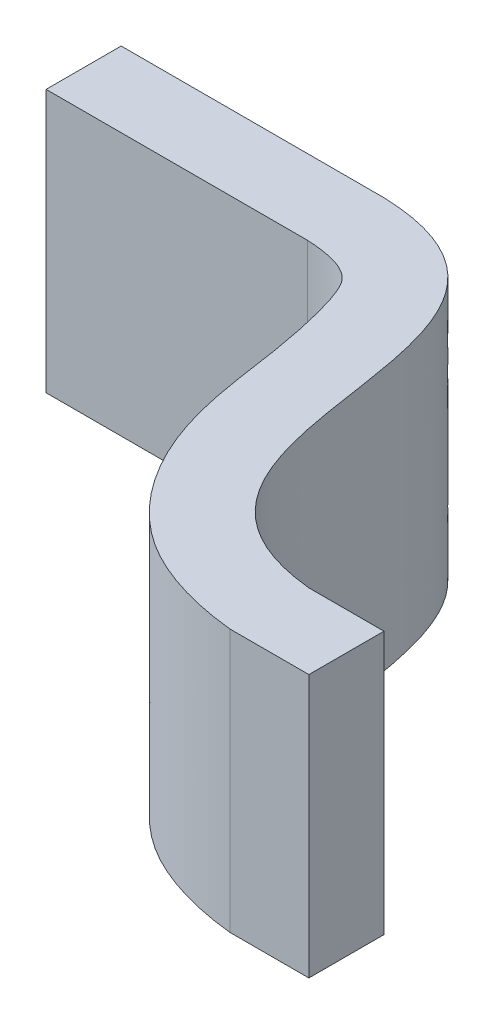
ISO-10303-21;
HEADER;
FILE_DESCRIPTION(('STEP AP214'),'2;1');
FILE_NAME('part.step','',(''),(''),'','','');
FILE_SCHEMA(('AUTOMOTIVE_DESIGN { 1 0 10303 214 1 1 1 1 }'));
ENDSEC;
DATA;
#1=APPLICATION_CONTEXT('core data for automotive mechanical design processes');
#2=APPLICATION_PROTOCOL_DEFINITION('international standard','automotive_design',2000,#1);
#3=PRODUCT_CONTEXT('',#1,'mechanical');
#4=PRODUCT('Part','Part','',(#3));
#5=PRODUCT_RELATED_PRODUCT_CATEGORY('part','',(#4));
#6=PRODUCT_DEFINITION_FORMATION('','',#4);
#7=PRODUCT_DEFINITION_CONTEXT('part definition',#1,'design');
#8=PRODUCT_DEFINITION('design','',#6,#7);
#9=PRODUCT_DEFINITION_SHAPE('','',#8);
#10=(LENGTH_UNIT() NAMED_UNIT(*) SI_UNIT(.MILLI.,.METRE.));
#11=(NAMED_UNIT(*) PLANE_ANGLE_UNIT() SI_UNIT($,.RADIAN.));
#12=(NAMED_UNIT(*) SI_UNIT($,.STERADIAN.) SOLID_ANGLE_UNIT());
#13=UNCERTAINTY_MEASURE_WITH_UNIT(LENGTH_MEASURE(1.E-05),#10,'distance_accuracy_value','');
#14=(GEOMETRIC_REPRESENTATION_CONTEXT(3) GLOBAL_UNCERTAINTY_ASSIGNED_CONTEXT((#13)) GLOBAL_UNIT_ASSIGNED_CONTEXT((#10,
#11,#12)) REPRESENTATION_CONTEXT('',''));
#15=CARTESIAN_POINT('',(0.,0.,0.));
#16=DIRECTION('',(0.,0.,1.));
#17=DIRECTION('',(1.,0.,0.));
#18=AXIS2_PLACEMENT_3D('',#15,#16,#17);
#19=CARTESIAN_POINT('',(0.381062000989914,2.52312396585783,1.20000011583518));
#20=DIRECTION('',(0.,-1.,-4.37113882867379E-08));
#21=DIRECTION('',(1.,0.,0.));
#22=AXIS2_PLACEMENT_3D('',#19,#20,#21);
#23=PLANE('',#22);
#24=CARTESIAN_POINT('',(-6.65393799901009,2.52312397460011,1.00000011583518));
#25=CARTESIAN_POINT('',(-6.67603378247592,2.52312397469533,0.997821625647136));
#26=CARTESIAN_POINT('',(-6.69814608533159,2.52312397483942,0.994525254588136));
#27=CARTESIAN_POINT('',(-6.74196000230599,2.52312397525691,0.984974262074383));
#28=CARTESIAN_POINT('',(-6.76365439120462,2.52312397553172,0.978687395714403));
#29=CARTESIAN_POINT('',(-6.80109928914061,2.52312397616423,0.964217324172016));
#30=CARTESIAN_POINT('',(-6.81711598043367,2.52312397649087,0.956744419949619));
#31=CARTESIAN_POINT('',(-6.84771104371223,2.52312397724919,0.93939617325215));
#32=CARTESIAN_POINT('',(-6.86229582381613,2.52312397768036,0.929532290820284));
#33=CARTESIAN_POINT('',(-6.88913715455262,2.52312397862777,0.907858082970574));
#34=CARTESIAN_POINT('',(-6.90145549336788,2.52312397914066,0.896124342958266));
#35=CARTESIAN_POINT('',(-6.92410333203055,2.52312398024537,0.870851464463278));
#36=CARTESIAN_POINT('',(-6.93442941955475,2.52312398083732,0.857309294454855));
#37=CARTESIAN_POINT('',(-6.96672356560466,2.52312398298411,0.80819665626022));
#38=CARTESIAN_POINT('',(-6.98364579428104,2.52312398468164,0.769361671126783));
#39=CARTESIAN_POINT('',(-7.00637915120374,2.52312398771056,0.700067882955552));
#40=CARTESIAN_POINT('',(-7.01393277364121,2.52312398902294,0.670044134037493));
#41=CARTESIAN_POINT('',(-7.02681062279047,2.52312399167122,0.60945855354598));
#42=CARTESIAN_POINT('',(-7.03213106678493,2.52312399300716,0.578895899629316));
#43=CARTESIAN_POINT('',(-7.04523612787774,2.523123996586,0.497021613893752));
#44=CARTESIAN_POINT('',(-7.0522656284455,2.5231239988335,0.445604791047078));
#45=CARTESIAN_POINT('',(-7.06583829430569,2.52312400218308,0.368975308105411));
#46=CARTESIAN_POINT('',(-7.0708647695897,2.52312400329557,0.343524341633869));
#47=CARTESIAN_POINT('',(-7.08290131021325,2.5231240054988,0.293120463878793));
#48=CARTESIAN_POINT('',(-7.08990811721131,2.52312400658957,0.268166805951377));
#49=CARTESIAN_POINT('',(-7.10754242158977,2.52312400877064,0.218269756020573));
#50=CARTESIAN_POINT('',(-7.11830963205074,2.523124009859,0.193370816281341));
#51=CARTESIAN_POINT('',(-7.13814509854049,2.52312401139717,0.158181376299546));
#52=CARTESIAN_POINT('',(-7.14534233177561,2.52312401189274,0.14684408259658));
#53=CARTESIAN_POINT('',(-7.16105988122924,2.52312401284169,0.125134668490089));
#54=CARTESIAN_POINT('',(-7.16957893209141,2.52312401329511,0.114761640040044));
#55=CARTESIAN_POINT('',(-7.19091439754605,2.52312401428579,0.0920977228508133));
#56=CARTESIAN_POINT('',(-7.20423043199209,2.52312401480287,0.080268161159152));
#57=CARTESIAN_POINT('',(-7.23280529274656,2.52312401572307,0.0592163446176012));
#58=CARTESIAN_POINT('',(-7.24806736713441,2.523124016126,0.0499985337989568));
#59=CARTESIAN_POINT('',(-7.28055680499388,2.52312401683092,0.0338719510890794));
#60=CARTESIAN_POINT('',(-7.29784019259106,2.52312401712787,0.027078271498908));
#61=CARTESIAN_POINT('',(-7.33320890349723,2.52312401761224,0.0159971892214287));
#62=CARTESIAN_POINT('',(-7.35129600434054,2.5231240177994,0.0117156730828428));
#63=CARTESIAN_POINT('',(-7.383534227059,2.52312401805053,0.00597062766915512));
#64=CARTESIAN_POINT('',(-7.39761496113673,2.52312401813308,0.00408194344411856));
#65=CARTESIAN_POINT('',(-7.42577624030721,2.52312401825332,0.00133095304899405));
#66=CARTESIAN_POINT('',(-7.43985605615936,2.52312401829133,0.000461351631186638));
#67=CARTESIAN_POINT('',(-7.45393799901012,2.5231240183115,1.1583517777948E-07));
#68=B_SPLINE_CURVE_WITH_KNOTS('',3,(#24,#25,#26,#27,#28,#29,#30,#31,#32,#33,#34,#35,#36,#37,#38,
#39,#40,#41,#42,#43,#44,#45,#46,#47,#48,#49,#50,#51,#52,#53,#54,#55,#56,#57,#58,#59,#60,#61,#62,
#63,#64,#65,#66,#67),.UNSPECIFIED.,.F.,.F.,(4,2,2,2,2,2,2,2,2,2,2,2,2,2,2,2,2,2,2,2,2,4),(0.,
0.0667821137090829,0.134301214684022,0.187128508823984,0.239707439757734,0.290518731452927,
0.341416294675053,0.466712259088969,0.559563019654505,0.652570428897918,0.808245450373591,
0.886023921415192,0.963675157190782,1.0445878496654,1.08478909463836,1.12495209032637,
1.17807587168456,1.23128951042009,1.2867700351769,1.34238004906254,1.38496468867344,
1.42724258099922),.UNSPECIFIED.);
#69=CARTESIAN_POINT('',(-6.65393799901009,2.52312397460011,1.00000011583518));
#70=VERTEX_POINT('',#69);
#71=CARTESIAN_POINT('',(-7.45393799901009,2.5231240183115,1.15835178959856E-07));
#72=VERTEX_POINT('',#71);
#73=EDGE_CURVE('E11',#70,#72,#68,.T.);
#74=ORIENTED_EDGE('',*,*,#73,.F.);
#75=DIRECTION('',(-1.,0.,0.));
#76=VECTOR('',#75,1.);
#77=CARTESIAN_POINT('',(-6.45393799901009,2.52312397460011,1.00000011583518));
#78=LINE('',#77,#76);
#79=CARTESIAN_POINT('',(-6.45393799901009,2.52312397460011,1.00000011583518));
#80=VERTEX_POINT('',#79);
#81=EDGE_CURVE('E177',#80,#70,#78,.T.);
#82=ORIENTED_EDGE('',*,*,#81,.F.);
#83=DIRECTION('',(0.,4.37113878426487E-08,-0.999999999999999));
#84=VECTOR('',#83,1.);
#85=CARTESIAN_POINT('',(-6.45393799901009,2.52312396585783,1.20000011583518));
#86=LINE('',#85,#84);
#87=CARTESIAN_POINT('',(-6.45393799901009,2.52312396585783,1.20000011583518));
#88=VERTEX_POINT('',#87);
#89=EDGE_CURVE('E156',#88,#80,#86,.T.);
#90=ORIENTED_EDGE('',*,*,#89,.F.);
#91=DIRECTION('',(-1.,0.,0.));
#92=VECTOR('',#91,1.);
#93=CARTESIAN_POINT('',(-6.45393799901009,2.52312396585783,1.20000011583518));
#94=LINE('',#93,#92);
#95=CARTESIAN_POINT('',(-6.66373717585809,2.52312396585783,1.20000011583518));
#96=VERTEX_POINT('',#95);
#97=EDGE_CURVE('E147',#88,#96,#94,.T.);
#98=ORIENTED_EDGE('',*,*,#97,.T.);
#99=CARTESIAN_POINT('',(-6.66373717585809,2.52312396585783,1.20000011583518));
#100=CARTESIAN_POINT('',(-6.68237056257263,2.52312396593834,1.19815826251359));
#101=CARTESIAN_POINT('',(-6.70094738722954,2.52312396604573,1.19570148608563));
#102=CARTESIAN_POINT('',(-6.73792461054779,2.52312396631693,1.18949708649844));
#103=CARTESIAN_POINT('',(-6.75632454194431,2.52312396648087,1.18574668900368));
#104=CARTESIAN_POINT('',(-6.7929675339705,2.52312396686924,1.17686171267063));
#105=CARTESIAN_POINT('',(-6.81120769181061,2.52312396709421,1.1717149784766));
#106=CARTESIAN_POINT('',(-6.84718412122,2.52312396760934,1.15993018576616));
#107=CARTESIAN_POINT('',(-6.86492077676558,2.52312396789945,1.15329330005595));
#108=CARTESIAN_POINT('',(-6.90550702441668,2.52312396866299,1.13582558687806));
#109=CARTESIAN_POINT('',(-6.92808530032362,2.52312396916528,1.12433438176827));
#110=CARTESIAN_POINT('',(-6.97098069443299,2.52312397032142,1.09788516164198));
#111=CARTESIAN_POINT('',(-6.99130790145501,2.52312397097454,1.08294362493378));
#112=CARTESIAN_POINT('',(-7.0279727762332,2.52312397234773,1.0515286278821));
#113=CARTESIAN_POINT('',(-7.04449924398274,2.52312397305833,1.03527193186483));
#114=CARTESIAN_POINT('',(-7.07543365798621,2.52312397456551,1.00079161319615));
#115=CARTESIAN_POINT('',(-7.08983601944683,2.52312397536231,0.98256301639458));
#116=CARTESIAN_POINT('',(-7.11809776879426,2.52312397712182,0.942310234871584));
#117=CARTESIAN_POINT('',(-7.13168204827002,2.52312397809294,0.92009344839241));
#118=CARTESIAN_POINT('',(-7.15606790009834,2.52312398009773,0.874229233248659));
#119=CARTESIAN_POINT('',(-7.16687319447414,2.52312398113131,0.850583771081586));
#120=CARTESIAN_POINT('',(-7.18657911699553,2.5231239833315,0.800249242615178));
#121=CARTESIAN_POINT('',(-7.19524763842126,2.52312398450204,0.773470351336701));
#122=CARTESIAN_POINT('',(-7.20996785968964,2.5231239868744,0.719197095461251));
#123=CARTESIAN_POINT('',(-7.21601637646933,2.52312398807626,0.691701903357667));
#124=CARTESIAN_POINT('',(-7.22445706680594,2.52312399004254,0.646718698606681));
#125=CARTESIAN_POINT('',(-7.22737168105378,2.52312399080298,0.629321559392239));
#126=CARTESIAN_POINT('',(-7.23282112861414,2.5231239923266,0.594465151128248));
#127=CARTESIAN_POINT('',(-7.23535587567411,2.52312399308977,0.577005868887041));
#128=CARTESIAN_POINT('',(-7.24044379035748,2.52312399461587,0.542092921691093));
#129=CARTESIAN_POINT('',(-7.24299695433449,2.52312399537879,0.524639256302372));
#130=CARTESIAN_POINT('',(-7.24854024165721,2.52312399690142,0.489805710668549));
#131=CARTESIAN_POINT('',(-7.25153024685593,2.52312399766112,0.472425811776499));
#132=CARTESIAN_POINT('',(-7.25940543221582,2.52312399951487,0.430017002300889));
#133=CARTESIAN_POINT('',(-7.26454124775707,2.52312400060698,0.405032274084385));
#134=CARTESIAN_POINT('',(-7.27335782095331,2.52312400223388,0.367812997253913));
#135=CARTESIAN_POINT('',(-7.27648289514104,2.52312400277442,0.355447076609882));
#136=CARTESIAN_POINT('',(-7.2832453862984,2.52312400384923,0.330858185679059));
#137=CARTESIAN_POINT('',(-7.28688251537886,2.52312400438351,0.318635139218726));
#138=CARTESIAN_POINT('',(-7.29335647517369,2.52312400522548,0.299373483484269));
#139=CARTESIAN_POINT('',(-7.29591902475202,2.52312400553713,0.292244069713019));
#140=CARTESIAN_POINT('',(-7.30149713681058,2.52312400615219,0.278171981621582));
#141=CARTESIAN_POINT('',(-7.30451201316556,2.52312400645562,0.271229042931886));
#142=CARTESIAN_POINT('',(-7.31077994191444,2.52312400699033,0.259000030679787));
#143=CARTESIAN_POINT('',(-7.31388605246379,2.52312400722459,0.25364485399594));
#144=CARTESIAN_POINT('',(-7.32081621454635,2.52312400763189,0.244316112999451));
#145=CARTESIAN_POINT('',(-7.32451240161513,2.5231240078089,0.240254092219713));
#146=CARTESIAN_POINT('',(-7.33396137139944,2.52312400816834,0.232076082050639));
#147=CARTESIAN_POINT('',(-7.33999881820825,2.52312400833669,0.228304167822834));
#148=CARTESIAN_POINT('',(-7.34921547868647,2.52312400855971,0.223113207552908));
#149=CARTESIAN_POINT('',(-7.35230200427145,2.52312400862892,0.221466276160532));
#150=CARTESIAN_POINT('',(-7.35859228869369,2.52312400876615,0.218417487597745));
#151=CARTESIAN_POINT('',(-7.36179572518167,2.52312400883417,0.217015010267047));
#152=CARTESIAN_POINT('',(-7.37091592035366,2.5231240089993,0.213465158251479));
#153=CARTESIAN_POINT('',(-7.37694933123149,2.52312400907601,0.211621815116612));
#154=CARTESIAN_POINT('',(-7.38671809463102,2.52312400917547,0.209137323184538));
#155=CARTESIAN_POINT('',(-7.3904112741511,2.52312400920754,0.208309808914051));
#156=CARTESIAN_POINT('',(-7.39782685498994,2.52312400927044,0.206799773992659));
#157=CARTESIAN_POINT('',(-7.40154925199958,2.52312400930127,0.206117232362366));
#158=CARTESIAN_POINT('',(-7.41391207862736,2.52312400939426,0.204032192061861));
#159=CARTESIAN_POINT('',(-7.42259188256675,2.52312400944441,0.20286122616549));
#160=CARTESIAN_POINT('',(-7.43564284724014,2.52312400950454,0.201476711110414));
#161=CARTESIAN_POINT('',(-7.4399954739608,2.52312400952207,0.201077337289078));
#162=CARTESIAN_POINT('',(-7.44871111958986,2.52312400955075,0.200424106581843));
#163=CARTESIAN_POINT('',(-7.45307413753338,2.52312400956191,0.200170236676359));
#164=CARTESIAN_POINT('',(-7.45744178074609,2.52312400956922,0.200000115835179));
#165=B_SPLINE_CURVE_WITH_KNOTS('',3,(#99,#100,#101,#102,#103,#104,#105,#106,#107,#108,#109,#110,
#111,#112,#113,#114,#115,#116,#117,#118,#119,#120,#121,#122,#123,#124,#125,#126,#127,#128,#129,
#130,#131,#132,#133,#134,#135,#136,#137,#138,#139,#140,#141,#142,#143,#144,#145,#146,#147,#148,
#149,#150,#151,#152,#153,#154,#155,#156,#157,#158,#159,#160,#161,#162,#163,#164),.UNSPECIFIED.,
.F.,.F.,(4,2,2,2,2,2,2,2,2,2,2,2,2,2,2,2,2,2,2,2,2,2,2,2,2,2,2,2,2,2,2,2,4),(0.,
0.0561681589095698,0.112457534383135,0.169253578612363,0.226005077906877,0.301715004036535,
0.377070566345992,0.446424912055147,0.515958475234815,0.593880428548582,0.671697467408242,
0.755964517163008,0.840333658382207,0.893247792631838,0.94617392340737,0.999089848164161,
1.05199148781442,1.12847716172405,1.16673541076623,1.20497223539783,1.22769072756633,
1.25037510056686,1.26886797593494,1.28517999290264,1.30634908955326,1.31685139211729,
1.32732665061524,1.34619861049413,1.3575513722042,1.36890248990408,1.39515927363249,
1.40827024085607,1.42138003473644),.UNSPECIFIED.);
#166=CARTESIAN_POINT('',(-7.45744178074609,2.52312400956922,0.200000115835179));
#167=VERTEX_POINT('',#166);
#168=EDGE_CURVE('E135',#96,#167,#165,.T.);
#169=ORIENTED_EDGE('',*,*,#168,.T.);
#170=DIRECTION('',(1.,0.,0.));
#171=VECTOR('',#170,1.);
#172=CARTESIAN_POINT('',(-8.15393799901009,2.52312400956922,0.200000115835177));
#173=LINE('',#172,#171);
#174=CARTESIAN_POINT('',(-8.15393799901009,2.52312400956922,0.200000115835179));
#175=VERTEX_POINT('',#174);
#176=EDGE_CURVE('E97',#175,#167,#173,.T.);
#177=ORIENTED_EDGE('',*,*,#176,.F.);
#178=DIRECTION('',(0.,4.37113878426487E-08,-0.999999999999999));
#179=VECTOR('',#178,1.);
#180=CARTESIAN_POINT('',(-8.15393799901009,2.52312400956922,0.200000115835179));
#181=LINE('',#180,#179);
#182=CARTESIAN_POINT('',(-8.15393799901009,2.5231240183115,1.15835178959856E-07));
#183=VERTEX_POINT('',#182);
#184=EDGE_CURVE('E102',#175,#183,#181,.T.);
#185=ORIENTED_EDGE('',*,*,#184,.T.);
#186=DIRECTION('',(-1.,0.,0.));
#187=VECTOR('',#186,1.);
#188=CARTESIAN_POINT('',(-7.45393799901009,2.5231240183115,1.15835178959856E-07));
#189=LINE('',#188,#187);
#190=EDGE_CURVE('E95',#72,#183,#189,.T.);
#191=ORIENTED_EDGE('',*,*,#190,.F.);
#192=EDGE_LOOP('',(#74,#82,#90,#98,#169,#177,#185,#191));
#193=FACE_BOUND('',#192,.T.);
#194=ADVANCED_FACE('F17',(#193),#23,.T.);
#195=CARTESIAN_POINT('',(0.381062000989914,3.22312396585783,1.20000014643315));
#196=DIRECTION('',(0.,-1.,-4.37113882867379E-08));
#197=DIRECTION('',(1.,0.,0.));
#198=AXIS2_PLACEMENT_3D('',#195,#196,#197);
#199=PLANE('',#198);
#200=DIRECTION('',(-1.,0.,0.));
#201=VECTOR('',#200,1.);
#202=CARTESIAN_POINT('',(-6.45393799901009,3.22312397460011,1.00000014643315));
#203=LINE('',#202,#201);
#204=CARTESIAN_POINT('',(-6.45393799901009,3.22312397460011,1.00000014643315));
#205=VERTEX_POINT('',#204);
#206=CARTESIAN_POINT('',(-6.65393799901009,3.22312397460011,1.00000014643315));
#207=VERTEX_POINT('',#206);
#208=EDGE_CURVE('E30',#205,#207,#203,.T.);
#209=ORIENTED_EDGE('',*,*,#208,.T.);
#210=CARTESIAN_POINT('',(-6.65393799901009,3.22312397460011,1.00000014643315));
#211=CARTESIAN_POINT('',(-6.67603378247592,3.22312397469533,0.997821656245107));
#212=CARTESIAN_POINT('',(-6.69814608533159,3.22312397483942,0.994525285186108));
#213=CARTESIAN_POINT('',(-6.74196000230599,3.22312397525691,0.984974292672355));
#214=CARTESIAN_POINT('',(-6.76365439120462,3.22312397553172,0.978687426312375));
#215=CARTESIAN_POINT('',(-6.80109928914061,3.22312397616423,0.964217354769987));
#216=CARTESIAN_POINT('',(-6.81711598043367,3.22312397649087,0.95674445054759));
#217=CARTESIAN_POINT('',(-6.84771104371223,3.22312397724919,0.939396203850121));
#218=CARTESIAN_POINT('',(-6.86229582381613,3.22312397768036,0.929532321418256));
#219=CARTESIAN_POINT('',(-6.88913715455262,3.22312397862777,0.907858113568546));
#220=CARTESIAN_POINT('',(-6.90145549336788,3.22312397914066,0.896124373556238));
#221=CARTESIAN_POINT('',(-6.92410333203055,3.22312398024537,0.87085149506125));
#222=CARTESIAN_POINT('',(-6.93442941955475,3.22312398083732,0.857309325052827));
#223=CARTESIAN_POINT('',(-6.96672356560466,3.22312398298411,0.808196686858193));
#224=CARTESIAN_POINT('',(-6.98364579428104,3.22312398468164,0.769361701724755));
#225=CARTESIAN_POINT('',(-7.00637915120374,3.22312398771057,0.700067913553523));
#226=CARTESIAN_POINT('',(-7.01393277364121,3.22312398902294,0.670044164635465));
#227=CARTESIAN_POINT('',(-7.02681062279047,3.22312399167122,0.609458584143952));
#228=CARTESIAN_POINT('',(-7.03213106678493,3.22312399300716,0.578895930227288));
#229=CARTESIAN_POINT('',(-7.04523612787774,3.223123996586,0.497021644491724));
#230=CARTESIAN_POINT('',(-7.0522656284455,3.2231239988335,0.44560482164505));
#231=CARTESIAN_POINT('',(-7.06583829430569,3.22312400218308,0.368975338703383));
#232=CARTESIAN_POINT('',(-7.0708647695897,3.22312400329557,0.343524372231841));
#233=CARTESIAN_POINT('',(-7.08290131021325,3.2231240054988,0.293120494476765));
#234=CARTESIAN_POINT('',(-7.08990811721131,3.22312400658957,0.268166836549349));
#235=CARTESIAN_POINT('',(-7.10754242158977,3.22312400877064,0.218269786618545));
#236=CARTESIAN_POINT('',(-7.11830963205074,3.223124009859,0.193370846879313));
#237=CARTESIAN_POINT('',(-7.13814509854049,3.22312401139717,0.158181406897518));
#238=CARTESIAN_POINT('',(-7.14534233177561,3.22312401189274,0.146844113194552));
#239=CARTESIAN_POINT('',(-7.16105988122924,3.22312401284169,0.125134699088061));
#240=CARTESIAN_POINT('',(-7.16957893209141,3.22312401329511,0.114761670638016));
#241=CARTESIAN_POINT('',(-7.19091439754605,3.22312401428579,0.092097753448785));
#242=CARTESIAN_POINT('',(-7.20423043199209,3.22312401480287,0.0802681917571236));
#243=CARTESIAN_POINT('',(-7.23280529274656,3.22312401572307,0.0592163752155729));
#244=CARTESIAN_POINT('',(-7.24806736713441,3.223124016126,0.0499985643969287));
#245=CARTESIAN_POINT('',(-7.28055680499388,3.22312401683092,0.0338719816870514));
#246=CARTESIAN_POINT('',(-7.29784019259106,3.22312401712787,0.0270783020968798));
#247=CARTESIAN_POINT('',(-7.33320890349723,3.22312401761224,0.0159972198194005));
#248=CARTESIAN_POINT('',(-7.35129600434054,3.2231240177994,0.0117157036808147));
#249=CARTESIAN_POINT('',(-7.383534227059,3.22312401805053,0.00597065826712698));
#250=CARTESIAN_POINT('',(-7.39761496113673,3.22312401813308,0.00408197404209039));
#251=CARTESIAN_POINT('',(-7.42577624030721,3.22312401825332,0.00133098364696583));
#252=CARTESIAN_POINT('',(-7.43985605615936,3.22312401829133,0.000461382229158383));
#253=CARTESIAN_POINT('',(-7.45393799901012,3.2231240183115,1.46433149535788E-07));
#254=B_SPLINE_CURVE_WITH_KNOTS('',3,(#210,#211,#212,#213,#214,#215,#216,#217,#218,#219,#220,
#221,#222,#223,#224,#225,#226,#227,#228,#229,#230,#231,#232,#233,#234,#235,#236,#237,#238,#239,
#240,#241,#242,#243,#244,#245,#246,#247,#248,#249,#250,#251,#252,#253),.UNSPECIFIED.,.F.,.F.,(4,
2,2,2,2,2,2,2,2,2,2,2,2,2,2,2,2,2,2,2,2,4),(0.,0.0667821137090826,0.134301214684021,
0.187128508823984,0.239707439757734,0.290518731452926,0.341416294675052,0.466712259088968,
0.559563019654505,0.652570428897917,0.808245450373591,0.886023921415191,0.963675157190781,
1.0445878496654,1.08478909463836,1.12495209032637,1.17807587168456,1.23128951042009,
1.2867700351769,1.34238004906254,1.38496468867344,1.42724258099922),.UNSPECIFIED.);
#255=CARTESIAN_POINT('',(-7.45393799901009,3.2231240183115,1.46433150760572E-07));
#256=VERTEX_POINT('',#255);
#257=EDGE_CURVE('E159',#207,#256,#254,.T.);
#258=ORIENTED_EDGE('',*,*,#257,.T.);
#259=DIRECTION('',(-1.,0.,0.));
#260=VECTOR('',#259,1.);
#261=CARTESIAN_POINT('',(-7.45393799901009,3.2231240183115,1.46433150760572E-07));
#262=LINE('',#261,#260);
#263=CARTESIAN_POINT('',(-8.15393799901009,3.2231240183115,1.46433150760572E-07));
#264=VERTEX_POINT('',#263);
#265=EDGE_CURVE('E96',#256,#264,#262,.T.);
#266=ORIENTED_EDGE('',*,*,#265,.T.);
#267=DIRECTION('',(0.,4.37113856222026E-08,-0.999999999999999));
#268=VECTOR('',#267,1.);
#269=CARTESIAN_POINT('',(-8.15393799901009,3.22312400956922,0.200000146433151));
#270=LINE('',#269,#268);
#271=CARTESIAN_POINT('',(-8.15393799901009,3.22312400956922,0.200000146433151));
#272=VERTEX_POINT('',#271);
#273=EDGE_CURVE('E141',#272,#264,#270,.T.);
#274=ORIENTED_EDGE('',*,*,#273,.F.);
#275=DIRECTION('',(1.,0.,0.));
#276=VECTOR('',#275,1.);
#277=CARTESIAN_POINT('',(-8.15393799901009,3.22312400956922,0.200000146433149));
#278=LINE('',#277,#276);
#279=CARTESIAN_POINT('',(-7.45744178074609,3.22312400956922,0.200000146433151));
#280=VERTEX_POINT('',#279);
#281=EDGE_CURVE('E193',#272,#280,#278,.T.);
#282=ORIENTED_EDGE('',*,*,#281,.T.);
#283=CARTESIAN_POINT('',(-6.66373717585809,3.22312396585783,1.20000014643315));
#284=CARTESIAN_POINT('',(-6.68237056257263,3.22312396593834,1.19815829311156));
#285=CARTESIAN_POINT('',(-6.70094738722954,3.22312396604573,1.1957015166836));
#286=CARTESIAN_POINT('',(-6.73792461054779,3.22312396631693,1.18949711709641));
#287=CARTESIAN_POINT('',(-6.75632454194431,3.22312396648087,1.18574671960165));
#288=CARTESIAN_POINT('',(-6.7929675339705,3.22312396686924,1.1768617432686));
#289=CARTESIAN_POINT('',(-6.81120769181061,3.22312396709421,1.17171500907457));
#290=CARTESIAN_POINT('',(-6.84718412122,3.22312396760934,1.15993021636413));
#291=CARTESIAN_POINT('',(-6.86492077676558,3.22312396789945,1.15329333065392));
#292=CARTESIAN_POINT('',(-6.90550702441668,3.22312396866299,1.13582561747603));
#293=CARTESIAN_POINT('',(-6.92808530032362,3.22312396916528,1.12433441236624));
#294=CARTESIAN_POINT('',(-6.97098069443299,3.22312397032142,1.09788519223995));
#295=CARTESIAN_POINT('',(-6.99130790145501,3.22312397097454,1.08294365553175));
#296=CARTESIAN_POINT('',(-7.0279727762332,3.22312397234773,1.05152865848007));
#297=CARTESIAN_POINT('',(-7.04449924398274,3.22312397305833,1.03527196246281));
#298=CARTESIAN_POINT('',(-7.07543365798621,3.22312397456551,1.00079164379412));
#299=CARTESIAN_POINT('',(-7.08983601944683,3.22312397536231,0.982563046992551));
#300=CARTESIAN_POINT('',(-7.11809776879426,3.22312397712182,0.942310265469555));
#301=CARTESIAN_POINT('',(-7.13168204827002,3.22312397809294,0.920093478990381));
#302=CARTESIAN_POINT('',(-7.15606790009834,3.22312398009773,0.87422926384663));
#303=CARTESIAN_POINT('',(-7.16687319447414,3.22312398113131,0.850583801679557));
#304=CARTESIAN_POINT('',(-7.18657911699553,3.2231239833315,0.800249273213149));
#305=CARTESIAN_POINT('',(-7.19524763842126,3.22312398450204,0.773470381934673));
#306=CARTESIAN_POINT('',(-7.20996785968964,3.2231239868744,0.719197126059223));
#307=CARTESIAN_POINT('',(-7.21601637646933,3.22312398807626,0.691701933955639));
#308=CARTESIAN_POINT('',(-7.22445706680594,3.22312399004254,0.646718729204653));
#309=CARTESIAN_POINT('',(-7.22737168105378,3.22312399080298,0.629321589990211));
#310=CARTESIAN_POINT('',(-7.23282112861414,3.2231239923266,0.59446518172622));
#311=CARTESIAN_POINT('',(-7.23535587567411,3.22312399308977,0.577005899485013));
#312=CARTESIAN_POINT('',(-7.24044379035748,3.22312399461587,0.542092952289065));
#313=CARTESIAN_POINT('',(-7.24299695433449,3.22312399537879,0.524639286900344));
#314=CARTESIAN_POINT('',(-7.24854024165721,3.22312399690142,0.489805741266521));
#315=CARTESIAN_POINT('',(-7.25153024685593,3.22312399766112,0.47242584237447));
#316=CARTESIAN_POINT('',(-7.25940543221582,3.22312399951487,0.430017032898861));
#317=CARTESIAN_POINT('',(-7.26454124775707,3.22312400060698,0.405032304682357));
#318=CARTESIAN_POINT('',(-7.27335782095331,3.22312400223388,0.367813027851885));
#319=CARTESIAN_POINT('',(-7.27648289514104,3.22312400277441,0.355447107207853));
#320=CARTESIAN_POINT('',(-7.2832453862984,3.22312400384923,0.330858216277031));
#321=CARTESIAN_POINT('',(-7.28688251537886,3.22312400438353,0.318635169816698));
#322=CARTESIAN_POINT('',(-7.29335647517369,3.22312400522547,0.299373514082241));
#323=CARTESIAN_POINT('',(-7.29591902475202,3.22312400553709,0.292244100310991));
#324=CARTESIAN_POINT('',(-7.30149713681058,3.22312400615223,0.278172012219554));
#325=CARTESIAN_POINT('',(-7.30451201316556,3.22312400645575,0.271229073529858));
#326=CARTESIAN_POINT('',(-7.31077994191444,3.22312400699022,0.259000061277759));
#327=CARTESIAN_POINT('',(-7.31388605246379,3.22312400722422,0.253644884593912));
#328=CARTESIAN_POINT('',(-7.32081621454635,3.22312400763222,0.244316143597423));
#329=CARTESIAN_POINT('',(-7.32451240161513,3.22312400781004,0.240254122817685));
#330=CARTESIAN_POINT('',(-7.33396137139944,3.22312400816656,0.232076112648611));
#331=CARTESIAN_POINT('',(-7.33999881820825,3.22312400832975,0.228304198420806));
#332=CARTESIAN_POINT('',(-7.34921547868647,3.22312400855853,0.22311323815088));
#333=CARTESIAN_POINT('',(-7.35230200427145,3.22312400863187,0.221466306758504));
#334=CARTESIAN_POINT('',(-7.35859228869369,3.22312400876321,0.218417518195717));
#335=CARTESIAN_POINT('',(-7.36179572518167,3.22312400882125,0.217015040865018));
#336=CARTESIAN_POINT('',(-7.37091592035366,3.22312400897159,0.21346518884945));
#337=CARTESIAN_POINT('',(-7.37694933123149,3.22312400905404,0.211621845714584));
#338=CARTESIAN_POINT('',(-7.38671809463102,3.22312400916708,0.20913735378251));
#339=CARTESIAN_POINT('',(-7.3904112741511,3.22312400920524,0.208309839512023));
#340=CARTESIAN_POINT('',(-7.39782685498994,3.22312400927275,0.20679980459063));
#341=CARTESIAN_POINT('',(-7.40154925199958,3.2231240093021,0.206117262960337));
#342=CARTESIAN_POINT('',(-7.41391207862736,3.22312400939235,0.204032222659832));
#343=CARTESIAN_POINT('',(-7.42259188256675,3.22312400944403,0.202861256763462));
#344=CARTESIAN_POINT('',(-7.43564284724014,3.22312400950474,0.201476741708386));
#345=CARTESIAN_POINT('',(-7.4399954739608,3.22312400952216,0.20107736788705));
#346=CARTESIAN_POINT('',(-7.44871111958986,3.22312400955065,0.200424137179815));
#347=CARTESIAN_POINT('',(-7.45307413753338,3.22312400956172,0.200170267274331));
#348=CARTESIAN_POINT('',(-7.45744178074609,3.22312400956922,0.200000146433151));
#349=B_SPLINE_CURVE_WITH_KNOTS('',3,(#283,#284,#285,#286,#287,#288,#289,#290,#291,#292,#293,
#294,#295,#296,#297,#298,#299,#300,#301,#302,#303,#304,#305,#306,#307,#308,#309,#310,#311,#312,
#313,#314,#315,#316,#317,#318,#319,#320,#321,#322,#323,#324,#325,#326,#327,#328,#329,#330,#331,
#332,#333,#334,#335,#336,#337,#338,#339,#340,#341,#342,#343,#344,#345,#346,#347,#348),
.UNSPECIFIED.,.F.,.F.,(4,2,2,2,2,2,2,2,2,2,2,2,2,2,2,2,2,2,2,2,2,2,2,2,2,2,2,2,2,2,2,2,4),(0.,
0.0561681589095695,0.112457534383135,0.169253578612364,0.226005077906877,0.301715004036536,
0.377070566345993,0.446424912055148,0.515958475234815,0.593880428548583,0.671697467408243,
0.755964517163007,0.840333658382207,0.893247792631837,0.94617392340737,0.999089848164161,
1.05199148781441,1.12847716172405,1.16673541076623,1.20497223539783,1.22769072756633,
1.25037510056686,1.26886797593494,1.28517999290264,1.30634908955326,1.31685139211729,
1.32732665061524,1.34619861049413,1.3575513722042,1.36890248990408,1.39515927363249,
1.40827024085607,1.42138003473644),.UNSPECIFIED.);
#350=CARTESIAN_POINT('',(-6.66373717585809,3.22312396585783,1.20000014643315));
#351=VERTEX_POINT('',#350);
#352=EDGE_CURVE('E103',#351,#280,#349,.T.);
#353=ORIENTED_EDGE('',*,*,#352,.F.);
#354=DIRECTION('',(-1.,0.,0.));
#355=VECTOR('',#354,1.);
#356=CARTESIAN_POINT('',(-6.45393799901009,3.22312396585783,1.20000014643315));
#357=LINE('',#356,#355);
#358=CARTESIAN_POINT('',(-6.45393799901009,3.22312396585783,1.20000014643315));
#359=VERTEX_POINT('',#358);
#360=EDGE_CURVE('E165',#359,#351,#357,.T.);
#361=ORIENTED_EDGE('',*,*,#360,.F.);
#362=DIRECTION('',(0.,4.37113878426487E-08,-0.999999999999999));
#363=VECTOR('',#362,1.);
#364=CARTESIAN_POINT('',(-6.45393799901009,3.22312396585783,1.20000014643315));
#365=LINE('',#364,#363);
#366=EDGE_CURVE('E98',#359,#205,#365,.T.);
#367=ORIENTED_EDGE('',*,*,#366,.T.);
#368=EDGE_LOOP('',(#209,#258,#266,#274,#282,#353,#361,#367));
#369=FACE_BOUND('',#368,.T.);
#370=ADVANCED_FACE('F117',(#369),#199,.F.);
#371=CARTESIAN_POINT('',(0.381062000989914,-0.126876034142165,1.2));
#372=DIRECTION('',(0.,-4.37113882867379E-08,1.));
#373=DIRECTION('',(0.,-1.,-4.37113882867379E-08));
#374=AXIS2_PLACEMENT_3D('',#371,#372,#373);
#375=PLANE('',#374);
#376=ORIENTED_EDGE('',*,*,#360,.T.);
#377=DIRECTION('',(0.,-0.999999999999999,-4.37113887942684E-08));
#378=VECTOR('',#377,1.);
#379=CARTESIAN_POINT('',(-6.66373717585809,3.22312396585784,1.20000014643315));
#380=LINE('',#379,#378);
#381=EDGE_CURVE('E151',#351,#96,#380,.T.);
#382=ORIENTED_EDGE('',*,*,#381,.T.);
#383=ORIENTED_EDGE('',*,*,#97,.F.);
#384=DIRECTION('',(0.,0.999999999999999,4.37113878426487E-08));
#385=VECTOR('',#384,1.);
#386=CARTESIAN_POINT('',(-6.45393799901009,2.52312396585783,1.20000011583518));
#387=LINE('',#386,#385);
#388=EDGE_CURVE('E189',#88,#359,#387,.T.);
#389=ORIENTED_EDGE('',*,*,#388,.T.);
#390=EDGE_LOOP('',(#376,#382,#383,#389));
#391=FACE_BOUND('',#390,.T.);
#392=ADVANCED_FACE('F170',(#391),#375,.T.);
#393=CARTESIAN_POINT('',(-8.15393799901009,-0.126876034142165,1.2));
#394=DIRECTION('',(-1.,0.,0.));
#395=DIRECTION('',(0.,-1.,-4.37113882867379E-08));
#396=AXIS2_PLACEMENT_3D('',#393,#394,#395);
#397=PLANE('',#396);
#398=DIRECTION('',(0.,-0.999999999999999,-4.37113883184585E-08));
#399=VECTOR('',#398,1.);
#400=CARTESIAN_POINT('',(-8.15393799901009,3.22312400956922,0.200000146433151));
#401=LINE('',#400,#399);
#402=EDGE_CURVE('E153',#272,#175,#401,.T.);
#403=ORIENTED_EDGE('',*,*,#402,.F.);
#404=ORIENTED_EDGE('',*,*,#273,.T.);
#405=DIRECTION('',(0.,0.999999999999999,4.37113882867379E-08));
#406=VECTOR('',#405,1.);
#407=CARTESIAN_POINT('',(-8.15393799901009,2.5231240183115,1.15835178959856E-07));
#408=LINE('',#407,#406);
#409=EDGE_CURVE('E199',#183,#264,#408,.T.);
#410=ORIENTED_EDGE('',*,*,#409,.F.);
#411=ORIENTED_EDGE('',*,*,#184,.F.);
#412=EDGE_LOOP('',(#403,#404,#410,#411));
#413=FACE_BOUND('',#412,.T.);
#414=ADVANCED_FACE('F206',(#413),#397,.T.);
#415=CARTESIAN_POINT('',(-6.45393799901009,-0.126876034142165,1.2));
#416=DIRECTION('',(-1.,0.,0.));
#417=DIRECTION('',(0.,-1.,-4.37113882867379E-08));
#418=AXIS2_PLACEMENT_3D('',#415,#416,#417);
#419=PLANE('',#418);
#420=ORIENTED_EDGE('',*,*,#89,.T.);
#421=DIRECTION('',(0.,-0.999999999999999,-4.37113881598552E-08));
#422=VECTOR('',#421,1.);
#423=CARTESIAN_POINT('',(-6.45393799901009,3.22312397460011,1.00000014643315));
#424=LINE('',#423,#422);
#425=EDGE_CURVE('E198',#205,#80,#424,.T.);
#426=ORIENTED_EDGE('',*,*,#425,.F.);
#427=ORIENTED_EDGE('',*,*,#366,.F.);
#428=ORIENTED_EDGE('',*,*,#388,.F.);
#429=EDGE_LOOP('',(#420,#426,#427,#428));
#430=FACE_BOUND('',#429,.T.);
#431=ADVANCED_FACE('F222',(#430),#419,.F.);
#432=CARTESIAN_POINT('',(0.381062000989914,-0.126875981688499,0.));
#433=DIRECTION('',(0.,-4.37113882867379E-08,1.));
#434=DIRECTION('',(0.,-1.,-4.37113882867379E-08));
#435=AXIS2_PLACEMENT_3D('',#432,#433,#434);
#436=PLANE('',#435);
#437=ORIENTED_EDGE('',*,*,#265,.F.);
#438=DIRECTION('',(0.,-0.999999999999999,-4.37113882867379E-08));
#439=VECTOR('',#438,1.);
#440=CARTESIAN_POINT('',(-7.45393799901009,3.2231240183115,1.46433150760572E-07));
#441=LINE('',#440,#439);
#442=EDGE_CURVE('E88',#256,#72,#441,.T.);
#443=ORIENTED_EDGE('',*,*,#442,.T.);
#444=ORIENTED_EDGE('',*,*,#190,.T.);
#445=ORIENTED_EDGE('',*,*,#409,.T.);
#446=EDGE_LOOP('',(#437,#443,#444,#445));
#447=FACE_BOUND('',#446,.T.);
#448=ADVANCED_FACE('F93',(#447),#436,.F.);
#449=CARTESIAN_POINT('',(-6.65393799901009,5.01775443609411,1.00000022487894));
#450=CARTESIAN_POINT('',(-7.29925539715409,5.01775443886489,0.93661226287194));
#451=CARTESIAN_POINT('',(-6.78984128963709,5.01775447886606,0.0214920441178097));
#452=CARTESIAN_POINT('',(-7.45393799901009,5.0177544798055,2.24878939694144E-07));
#453=B_SPLINE_CURVE_WITH_KNOTS('',3,(#449,#450,#451,#452),.UNSPECIFIED.,.F.,.F.,(4,4),(0.,1.),.UNSPECIFIED.);
#454=DIRECTION('',(0.,-0.999999999999999,-4.37113882867379E-08));
#455=VECTOR('',#454,1.);
#456=SURFACE_OF_LINEAR_EXTRUSION('',#453,#455);
#457=ORIENTED_EDGE('',*,*,#73,.T.);
#458=ORIENTED_EDGE('',*,*,#442,.F.);
#459=ORIENTED_EDGE('',*,*,#257,.F.);
#460=DIRECTION('',(0.,-0.999999999999999,-4.37113881598552E-08));
#461=VECTOR('',#460,1.);
#462=CARTESIAN_POINT('',(-6.65393799901009,3.22312397460011,1.00000014643315));
#463=LINE('',#462,#461);
#464=EDGE_CURVE('E89',#207,#70,#463,.T.);
#465=ORIENTED_EDGE('',*,*,#464,.T.);
#466=EDGE_LOOP('',(#457,#458,#459,#465));
#467=FACE_BOUND('',#466,.T.);
#468=ADVANCED_FACE('F86',(#467),#456,.F.);
#469=CARTESIAN_POINT('',(0.381062000989914,5.01775443609411,1.00000022487894));
#470=DIRECTION('',(0.,-4.37113882867379E-08,1.));
#471=DIRECTION('',(0.,-1.,-4.37113882867379E-08));
#472=AXIS2_PLACEMENT_3D('',#469,#470,#471);
#473=PLANE('',#472);
#474=ORIENTED_EDGE('',*,*,#81,.T.);
#475=ORIENTED_EDGE('',*,*,#464,.F.);
#476=ORIENTED_EDGE('',*,*,#208,.F.);
#477=ORIENTED_EDGE('',*,*,#425,.T.);
#478=EDGE_LOOP('',(#474,#475,#476,#477));
#479=FACE_BOUND('',#478,.T.);
#480=ADVANCED_FACE('F126',(#479),#473,.F.);
#481=CARTESIAN_POINT('',(-6.66373717585809,5.01775442735183,1.20000022487894));
#482=CARTESIAN_POINT('',(-6.76111157736509,5.01775442776993,1.19043537372094));
#483=CARTESIAN_POINT('',(-6.96545999269509,5.01775443018266,1.13523848292794));
#484=CARTESIAN_POINT('',(-7.20605275525609,5.01775444236442,0.85655227210794));
#485=CARTESIAN_POINT('',(-7.23834982502609,5.01775445822105,0.49379478761794));
#486=CARTESIAN_POINT('',(-7.29819788966409,5.01775446848464,0.25899132482694));
#487=CARTESIAN_POINT('',(-7.33605449676609,5.0177544697967,0.22897490490494));
#488=CARTESIAN_POINT('',(-7.37899552435409,5.01775447070118,0.20828275194794));
#489=CARTESIAN_POINT('',(-7.43390389640609,5.01775447102387,0.20090043049794));
#490=CARTESIAN_POINT('',(-7.45744178074609,5.01775447106322,0.20000022487894));
#491=B_SPLINE_CURVE_WITH_KNOTS('',3,(#481,#482,#483,#484,#485,#486,#487,#488,#489,#490),
.UNSPECIFIED.,.F.,.F.,(4,1,1,1,1,1,1,4),(-0.005037439357121,0.120331553469,0.245700546295,
0.496438531947,0.747176517599,0.872545510425,0.935230006838,0.997914503251),.UNSPECIFIED.);
#492=DIRECTION('',(0.,-0.999999999999999,-4.37113882867379E-08));
#493=VECTOR('',#492,1.);
#494=SURFACE_OF_LINEAR_EXTRUSION('',#491,#493);
#495=ORIENTED_EDGE('',*,*,#381,.F.);
#496=ORIENTED_EDGE('',*,*,#352,.T.);
#497=DIRECTION('',(0.,-0.999999999999999,-4.37113883184585E-08));
#498=VECTOR('',#497,1.);
#499=CARTESIAN_POINT('',(-7.45744178074609,3.22312400956922,0.200000146433151));
#500=LINE('',#499,#498);
#501=EDGE_CURVE('E107',#280,#167,#500,.T.);
#502=ORIENTED_EDGE('',*,*,#501,.T.);
#503=ORIENTED_EDGE('',*,*,#168,.F.);
#504=EDGE_LOOP('',(#495,#496,#502,#503));
#505=FACE_BOUND('',#504,.T.);
#506=ADVANCED_FACE('F119',(#505),#494,.T.);
#507=CARTESIAN_POINT('',(0.381062000989914,5.01775447106322,0.20000022487894));
#508=DIRECTION('',(0.,4.37113882867379E-08,-1.));
#509=DIRECTION('',(1.,0.,0.));
#510=AXIS2_PLACEMENT_3D('',#507,#508,#509);
#511=PLANE('',#510);
#512=ORIENTED_EDGE('',*,*,#176,.T.);
#513=ORIENTED_EDGE('',*,*,#501,.F.);
#514=ORIENTED_EDGE('',*,*,#281,.F.);
#515=ORIENTED_EDGE('',*,*,#402,.T.);
#516=EDGE_LOOP('',(#512,#513,#514,#515));
#517=FACE_BOUND('',#516,.T.);
#518=ADVANCED_FACE('F125',(#517),#511,.F.);
#519=CLOSED_SHELL('',(#194,#370,#392,#414,#431,#448,#468,#480,#506,#518));
#520=MANIFOLD_SOLID_BREP('B1',#519);
#521=ADVANCED_BREP_SHAPE_REPRESENTATION('',(#18,#520),#14);
#522=SHAPE_DEFINITION_REPRESENTATION(#9,#521);
ENDSEC;
END-ISO-10303-21;
